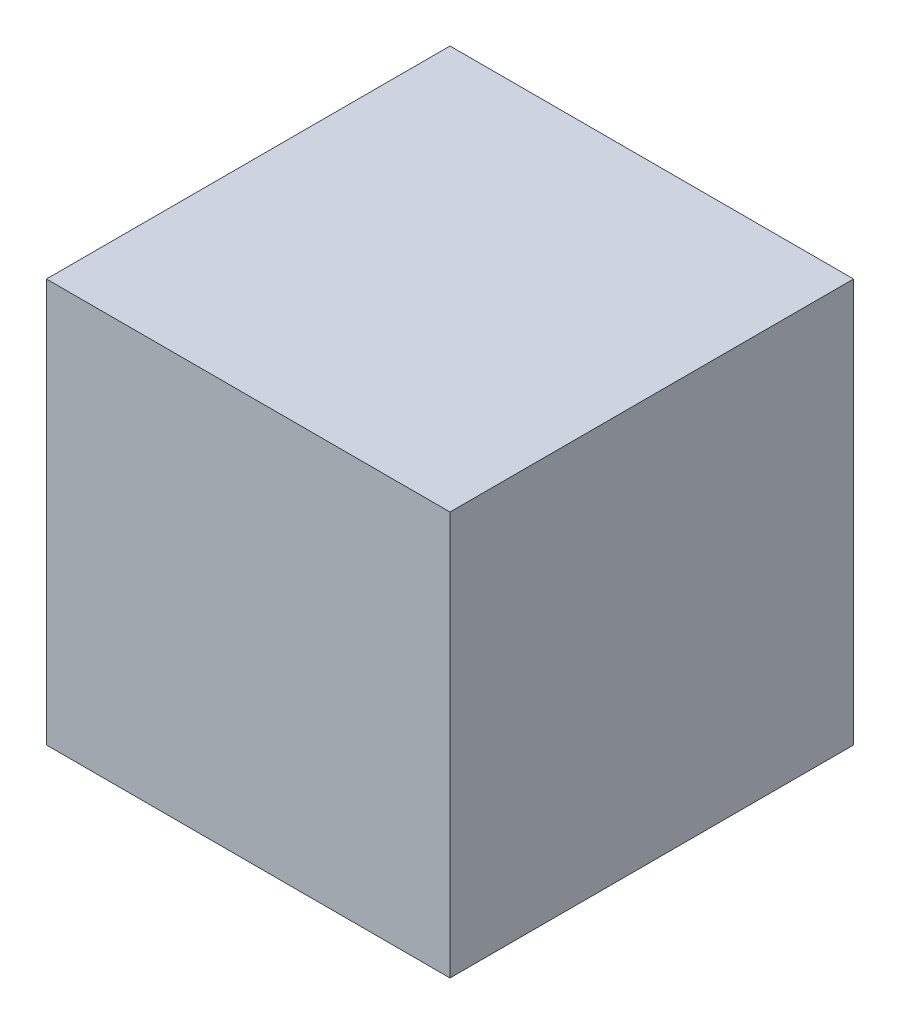
ISO-10303-21;
HEADER;
FILE_DESCRIPTION(('STEP AP214'),'2;1');
FILE_NAME('part.step','',(''),(''),'','','');
FILE_SCHEMA(('AUTOMOTIVE_DESIGN { 1 0 10303 214 1 1 1 1 }'));
ENDSEC;
DATA;
#1=APPLICATION_CONTEXT('core data for automotive mechanical design processes');
#2=APPLICATION_PROTOCOL_DEFINITION('international standard','automotive_design',2000,#1);
#3=PRODUCT_CONTEXT('',#1,'mechanical');
#4=PRODUCT('Part','Part','',(#3));
#5=PRODUCT_RELATED_PRODUCT_CATEGORY('part','',(#4));
#6=PRODUCT_DEFINITION_FORMATION('','',#4);
#7=PRODUCT_DEFINITION_CONTEXT('part definition',#1,'design');
#8=PRODUCT_DEFINITION('design','',#6,#7);
#9=PRODUCT_DEFINITION_SHAPE('','',#8);
#10=(LENGTH_UNIT() NAMED_UNIT(*) SI_UNIT(.MILLI.,.METRE.));
#11=(NAMED_UNIT(*) PLANE_ANGLE_UNIT() SI_UNIT($,.RADIAN.));
#12=(NAMED_UNIT(*) SI_UNIT($,.STERADIAN.) SOLID_ANGLE_UNIT());
#13=UNCERTAINTY_MEASURE_WITH_UNIT(LENGTH_MEASURE(1.E-05),#10,'distance_accuracy_value','');
#14=(GEOMETRIC_REPRESENTATION_CONTEXT(3) GLOBAL_UNCERTAINTY_ASSIGNED_CONTEXT((#13)) GLOBAL_UNIT_ASSIGNED_CONTEXT((#10,
#11,#12)) REPRESENTATION_CONTEXT('',''));
#15=CARTESIAN_POINT('',(0.,0.,0.));
#16=DIRECTION('',(0.,0.,1.));
#17=DIRECTION('',(1.,0.,0.));
#18=AXIS2_PLACEMENT_3D('',#15,#16,#17);
#19=CARTESIAN_POINT('',(35.35,-70.7,-35.35));
#20=DIRECTION('',(1.,0.,0.));
#21=DIRECTION('',(0.,0.,-1.));
#22=AXIS2_PLACEMENT_3D('',#19,#20,#21);
#23=PLANE('',#22);
#24=DIRECTION('',(0.,0.,-1.));
#25=VECTOR('',#24,1.);
#26=CARTESIAN_POINT('',(35.35,0.,-35.35));
#27=LINE('',#26,#25);
#28=CARTESIAN_POINT('',(35.35,0.,35.35));
#29=VERTEX_POINT('',#28);
#30=CARTESIAN_POINT('',(35.35,0.,-35.35));
#31=VERTEX_POINT('',#30);
#32=EDGE_CURVE('E109',#29,#31,#27,.T.);
#33=ORIENTED_EDGE('',*,*,#32,.F.);
#34=DIRECTION('',(0.,1.,0.));
#35=VECTOR('',#34,1.);
#36=CARTESIAN_POINT('',(35.35,-70.7,35.35));
#37=LINE('',#36,#35);
#38=CARTESIAN_POINT('',(35.35,-70.7,35.35));
#39=VERTEX_POINT('',#38);
#40=EDGE_CURVE('E11',#39,#29,#37,.T.);
#41=ORIENTED_EDGE('',*,*,#40,.F.);
#42=DIRECTION('',(0.,0.,-1.));
#43=VECTOR('',#42,1.);
#44=CARTESIAN_POINT('',(35.35,-70.7,-35.35));
#45=LINE('',#44,#43);
#46=CARTESIAN_POINT('',(35.35,-70.7,-35.35));
#47=VERTEX_POINT('',#46);
#48=EDGE_CURVE('E101',#39,#47,#45,.T.);
#49=ORIENTED_EDGE('',*,*,#48,.T.);
#50=DIRECTION('',(0.,1.,0.));
#51=VECTOR('',#50,1.);
#52=CARTESIAN_POINT('',(35.35,-70.7,-35.35));
#53=LINE('',#52,#51);
#54=EDGE_CURVE('E42',#47,#31,#53,.T.);
#55=ORIENTED_EDGE('',*,*,#54,.T.);
#56=EDGE_LOOP('',(#33,#41,#49,#55));
#57=FACE_BOUND('',#56,.T.);
#58=ADVANCED_FACE('F39',(#57),#23,.T.);
#59=CARTESIAN_POINT('',(-35.35,-70.7,35.35));
#60=DIRECTION('',(0.,0.,1.));
#61=DIRECTION('',(1.,0.,0.));
#62=AXIS2_PLACEMENT_3D('',#59,#60,#61);
#63=PLANE('',#62);
#64=DIRECTION('',(1.,0.,0.));
#65=VECTOR('',#64,1.);
#66=CARTESIAN_POINT('',(-35.35,0.,35.35));
#67=LINE('',#66,#65);
#68=CARTESIAN_POINT('',(-35.35,0.,35.35));
#69=VERTEX_POINT('',#68);
#70=EDGE_CURVE('E104',#69,#29,#67,.T.);
#71=ORIENTED_EDGE('',*,*,#70,.F.);
#72=DIRECTION('',(0.,1.,0.));
#73=VECTOR('',#72,1.);
#74=CARTESIAN_POINT('',(-35.35,-70.7,35.35));
#75=LINE('',#74,#73);
#76=CARTESIAN_POINT('',(-35.35,-70.7,35.35));
#77=VERTEX_POINT('',#76);
#78=EDGE_CURVE('E49',#77,#69,#75,.T.);
#79=ORIENTED_EDGE('',*,*,#78,.F.);
#80=DIRECTION('',(1.,0.,0.));
#81=VECTOR('',#80,1.);
#82=CARTESIAN_POINT('',(-35.35,-70.7,35.35));
#83=LINE('',#82,#81);
#84=EDGE_CURVE('E96',#77,#39,#83,.T.);
#85=ORIENTED_EDGE('',*,*,#84,.T.);
#86=ORIENTED_EDGE('',*,*,#40,.T.);
#87=EDGE_LOOP('',(#71,#79,#85,#86));
#88=FACE_BOUND('',#87,.T.);
#89=ADVANCED_FACE('F125',(#88),#63,.T.);
#90=CARTESIAN_POINT('',(-35.35,-70.7,-35.35));
#91=DIRECTION('',(-1.,0.,0.));
#92=DIRECTION('',(0.,0.,1.));
#93=AXIS2_PLACEMENT_3D('',#90,#91,#92);
#94=PLANE('',#93);
#95=DIRECTION('',(0.,0.,1.));
#96=VECTOR('',#95,1.);
#97=CARTESIAN_POINT('',(-35.35,0.,-35.35));
#98=LINE('',#97,#96);
#99=CARTESIAN_POINT('',(-35.35,0.,-35.35));
#100=VERTEX_POINT('',#99);
#101=EDGE_CURVE('E90',#100,#69,#98,.T.);
#102=ORIENTED_EDGE('',*,*,#101,.F.);
#103=DIRECTION('',(0.,1.,0.));
#104=VECTOR('',#103,1.);
#105=CARTESIAN_POINT('',(-35.35,-70.7,-35.35));
#106=LINE('',#105,#104);
#107=CARTESIAN_POINT('',(-35.35,-70.7,-35.35));
#108=VERTEX_POINT('',#107);
#109=EDGE_CURVE('E85',#108,#100,#106,.T.);
#110=ORIENTED_EDGE('',*,*,#109,.F.);
#111=DIRECTION('',(0.,0.,1.));
#112=VECTOR('',#111,1.);
#113=CARTESIAN_POINT('',(-35.35,-70.7,-35.35));
#114=LINE('',#113,#112);
#115=EDGE_CURVE('E88',#108,#77,#114,.T.);
#116=ORIENTED_EDGE('',*,*,#115,.T.);
#117=ORIENTED_EDGE('',*,*,#78,.T.);
#118=EDGE_LOOP('',(#102,#110,#116,#117));
#119=FACE_BOUND('',#118,.T.);
#120=ADVANCED_FACE('F87',(#119),#94,.T.);
#121=CARTESIAN_POINT('',(-35.35,-70.7,-35.35));
#122=DIRECTION('',(0.,0.,-1.));
#123=DIRECTION('',(-1.,0.,0.));
#124=AXIS2_PLACEMENT_3D('',#121,#122,#123);
#125=PLANE('',#124);
#126=DIRECTION('',(-1.,0.,0.));
#127=VECTOR('',#126,1.);
#128=CARTESIAN_POINT('',(-35.35,0.,-35.35));
#129=LINE('',#128,#127);
#130=EDGE_CURVE('E113',#31,#100,#129,.T.);
#131=ORIENTED_EDGE('',*,*,#130,.F.);
#132=ORIENTED_EDGE('',*,*,#54,.F.);
#133=DIRECTION('',(-1.,0.,0.));
#134=VECTOR('',#133,1.);
#135=CARTESIAN_POINT('',(-35.35,-70.7,-35.35));
#136=LINE('',#135,#134);
#137=EDGE_CURVE('E95',#47,#108,#136,.T.);
#138=ORIENTED_EDGE('',*,*,#137,.T.);
#139=ORIENTED_EDGE('',*,*,#109,.T.);
#140=EDGE_LOOP('',(#131,#132,#138,#139));
#141=FACE_BOUND('',#140,.T.);
#142=ADVANCED_FACE('F99',(#141),#125,.T.);
#143=CARTESIAN_POINT('',(0.,-70.7,0.));
#144=DIRECTION('',(0.,1.,0.));
#145=DIRECTION('',(0.,0.,1.));
#146=AXIS2_PLACEMENT_3D('',#143,#144,#145);
#147=PLANE('',#146);
#148=ORIENTED_EDGE('',*,*,#48,.F.);
#149=ORIENTED_EDGE('',*,*,#84,.F.);
#150=ORIENTED_EDGE('',*,*,#115,.F.);
#151=ORIENTED_EDGE('',*,*,#137,.F.);
#152=EDGE_LOOP('',(#148,#149,#150,#151));
#153=FACE_BOUND('',#152,.T.);
#154=ADVANCED_FACE('F94',(#153),#147,.F.);
#155=CARTESIAN_POINT('',(0.,0.,0.));
#156=DIRECTION('',(0.,1.,0.));
#157=DIRECTION('',(0.,0.,1.));
#158=AXIS2_PLACEMENT_3D('',#155,#156,#157);
#159=PLANE('',#158);
#160=ORIENTED_EDGE('',*,*,#32,.T.);
#161=ORIENTED_EDGE('',*,*,#130,.T.);
#162=ORIENTED_EDGE('',*,*,#101,.T.);
#163=ORIENTED_EDGE('',*,*,#70,.T.);
#164=EDGE_LOOP('',(#160,#161,#162,#163));
#165=FACE_BOUND('',#164,.T.);
#166=ADVANCED_FACE('F124',(#165),#159,.T.);
#167=CLOSED_SHELL('',(#58,#89,#120,#142,#154,#166));
#168=MANIFOLD_SOLID_BREP('B2',#167);
#169=ADVANCED_BREP_SHAPE_REPRESENTATION('',(#18,#168),#14);
#170=SHAPE_DEFINITION_REPRESENTATION(#9,#169);
ENDSEC;
END-ISO-10303-21;
